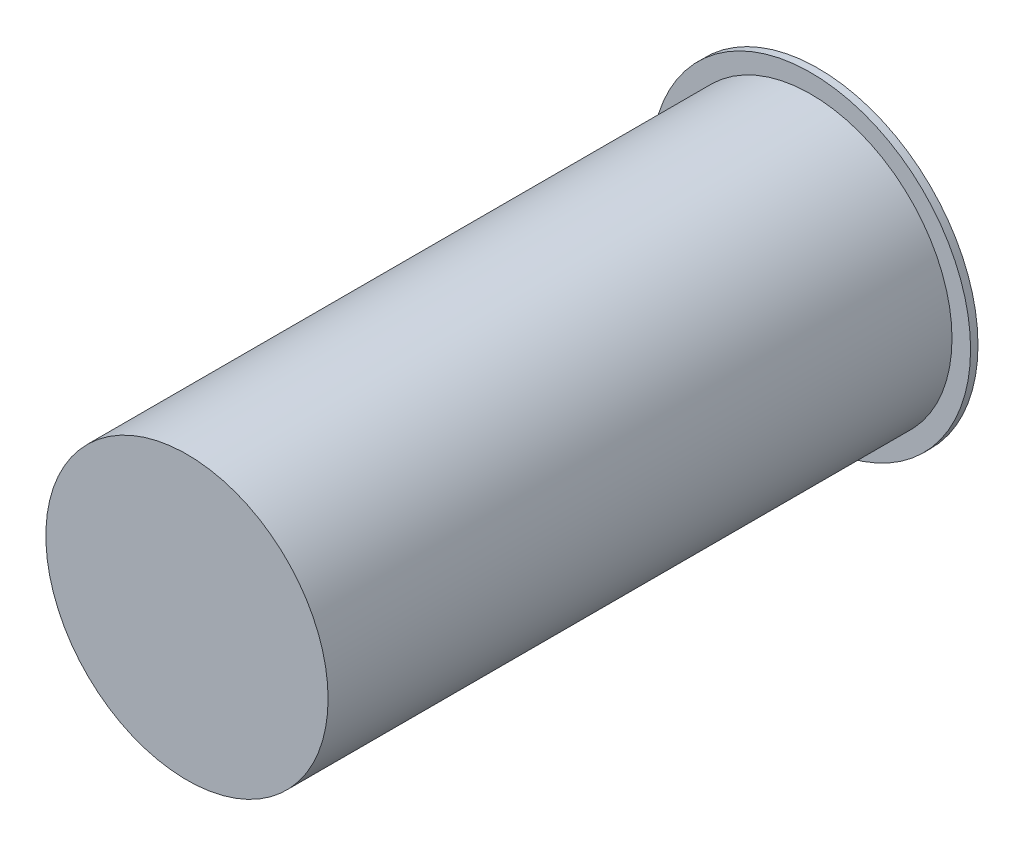
ISO-10303-21;
HEADER;
FILE_DESCRIPTION(('STEP AP214'),'2;1');
FILE_NAME('part.step','',(''),(''),'','','');
FILE_SCHEMA(('AUTOMOTIVE_DESIGN { 1 0 10303 214 1 1 1 1 }'));
ENDSEC;
DATA;
#1=APPLICATION_CONTEXT('core data for automotive mechanical design processes');
#2=APPLICATION_PROTOCOL_DEFINITION('international standard','automotive_design',2000,#1);
#3=PRODUCT_CONTEXT('',#1,'mechanical');
#4=PRODUCT('Part','Part','',(#3));
#5=PRODUCT_RELATED_PRODUCT_CATEGORY('part','',(#4));
#6=PRODUCT_DEFINITION_FORMATION('','',#4);
#7=PRODUCT_DEFINITION_CONTEXT('part definition',#1,'design');
#8=PRODUCT_DEFINITION('design','',#6,#7);
#9=PRODUCT_DEFINITION_SHAPE('','',#8);
#10=(LENGTH_UNIT() NAMED_UNIT(*) SI_UNIT(.MILLI.,.METRE.));
#11=(NAMED_UNIT(*) PLANE_ANGLE_UNIT() SI_UNIT($,.RADIAN.));
#12=(NAMED_UNIT(*) SI_UNIT($,.STERADIAN.) SOLID_ANGLE_UNIT());
#13=UNCERTAINTY_MEASURE_WITH_UNIT(LENGTH_MEASURE(1.E-05),#10,'distance_accuracy_value','');
#14=(GEOMETRIC_REPRESENTATION_CONTEXT(3) GLOBAL_UNCERTAINTY_ASSIGNED_CONTEXT((#13)) GLOBAL_UNIT_ASSIGNED_CONTEXT((#10,
#11,#12)) REPRESENTATION_CONTEXT('',''));
#15=CARTESIAN_POINT('',(0.,0.,0.));
#16=DIRECTION('',(0.,0.,1.));
#17=DIRECTION('',(1.,0.,0.));
#18=AXIS2_PLACEMENT_3D('',#15,#16,#17);
#19=CARTESIAN_POINT('',(8.,0.,-2.));
#20=DIRECTION('',(0.,0.,-1.));
#21=DIRECTION('',(-1.,0.,0.));
#22=AXIS2_PLACEMENT_3D('',#19,#20,#21);
#23=PLANE('',#22);
#24=CARTESIAN_POINT('',(0.,0.,-2.));
#25=DIRECTION('',(0.,0.,1.));
#26=DIRECTION('',(1.,0.,0.));
#27=AXIS2_PLACEMENT_3D('',#24,#25,#26);
#28=CIRCLE('',#27,8.);
#29=CARTESIAN_POINT('',(8.,0.,-2.));
#30=VERTEX_POINT('',#29);
#31=EDGE_CURVE('E54',#30,#30,#28,.T.);
#32=ORIENTED_EDGE('',*,*,#31,.F.);
#33=EDGE_LOOP('',(#32));
#34=FACE_BOUND('',#33,.T.);
#35=ADVANCED_FACE('F35',(#34),#23,.T.);
#36=CARTESIAN_POINT('',(0.,0.,42.));
#37=DIRECTION('',(0.,0.,1.));
#38=DIRECTION('',(1.,0.,0.));
#39=AXIS2_PLACEMENT_3D('',#36,#37,#38);
#40=PLANE('',#39);
#41=CARTESIAN_POINT('',(0.,0.,42.));
#42=DIRECTION('',(0.,0.,1.));
#43=DIRECTION('',(1.,0.,0.));
#44=AXIS2_PLACEMENT_3D('',#41,#42,#43);
#45=CIRCLE('',#44,9.5);
#46=CARTESIAN_POINT('',(9.5,0.,42.));
#47=VERTEX_POINT('',#46);
#48=EDGE_CURVE('E10',#47,#47,#45,.T.);
#49=ORIENTED_EDGE('',*,*,#48,.T.);
#50=EDGE_LOOP('',(#49));
#51=FACE_BOUND('',#50,.T.);
#52=ADVANCED_FACE('F62',(#51),#40,.T.);
#53=CARTESIAN_POINT('',(0.,0.,0.));
#54=DIRECTION('',(0.,0.,1.));
#55=DIRECTION('',(1.,0.,0.));
#56=AXIS2_PLACEMENT_3D('',#53,#54,#55);
#57=CYLINDRICAL_SURFACE('',#56,9.5);
#58=CARTESIAN_POINT('',(0.,0.,0.));
#59=DIRECTION('',(0.,0.,1.));
#60=DIRECTION('',(1.,0.,0.));
#61=AXIS2_PLACEMENT_3D('',#58,#59,#60);
#62=CIRCLE('',#61,9.5);
#63=CARTESIAN_POINT('',(9.5,0.,0.));
#64=VERTEX_POINT('',#63);
#65=EDGE_CURVE('E41',#64,#64,#62,.T.);
#66=ORIENTED_EDGE('',*,*,#65,.T.);
#67=EDGE_LOOP('',(#66));
#68=FACE_BOUND('',#67,.T.);
#69=ORIENTED_EDGE('',*,*,#48,.F.);
#70=EDGE_LOOP('',(#69));
#71=FACE_BOUND('',#70,.T.);
#72=ADVANCED_FACE('F66',(#68,#71),#57,.T.);
#73=CARTESIAN_POINT('',(9.5,0.,0.));
#74=DIRECTION('',(0.,0.,1.));
#75=DIRECTION('',(1.,0.,0.));
#76=AXIS2_PLACEMENT_3D('',#73,#74,#75);
#77=PLANE('',#76);
#78=CARTESIAN_POINT('',(0.,0.,0.));
#79=DIRECTION('',(0.,0.,1.));
#80=DIRECTION('',(1.,0.,0.));
#81=AXIS2_PLACEMENT_3D('',#78,#79,#80);
#82=CIRCLE('',#81,10.75);
#83=CARTESIAN_POINT('',(10.75,0.,0.));
#84=VERTEX_POINT('',#83);
#85=EDGE_CURVE('E45',#84,#84,#82,.T.);
#86=ORIENTED_EDGE('',*,*,#85,.T.);
#87=EDGE_LOOP('',(#86));
#88=FACE_BOUND('',#87,.T.);
#89=ORIENTED_EDGE('',*,*,#65,.F.);
#90=EDGE_LOOP('',(#89));
#91=FACE_BOUND('',#90,.T.);
#92=ADVANCED_FACE('F70',(#88,#91),#77,.T.);
#93=CARTESIAN_POINT('',(0.,0.,0.));
#94=DIRECTION('',(0.,0.,1.));
#95=DIRECTION('',(1.,0.,0.));
#96=AXIS2_PLACEMENT_3D('',#93,#94,#95);
#97=CYLINDRICAL_SURFACE('',#96,10.75);
#98=CARTESIAN_POINT('',(0.,0.,-0.5));
#99=DIRECTION('',(0.,0.,1.));
#100=DIRECTION('',(1.,0.,0.));
#101=AXIS2_PLACEMENT_3D('',#98,#99,#100);
#102=CIRCLE('',#101,10.75);
#103=CARTESIAN_POINT('',(10.75,0.,-0.5));
#104=VERTEX_POINT('',#103);
#105=EDGE_CURVE('E49',#104,#104,#102,.T.);
#106=ORIENTED_EDGE('',*,*,#105,.T.);
#107=EDGE_LOOP('',(#106));
#108=FACE_BOUND('',#107,.T.);
#109=ORIENTED_EDGE('',*,*,#85,.F.);
#110=EDGE_LOOP('',(#109));
#111=FACE_BOUND('',#110,.T.);
#112=ADVANCED_FACE('F75',(#108,#111),#97,.T.);
#113=CARTESIAN_POINT('',(0.,0.,-0.5));
#114=DIRECTION('',(0.,0.,1.));
#115=DIRECTION('',(1.,0.,0.));
#116=AXIS2_PLACEMENT_3D('',#113,#114,#115);
#117=CONICAL_SURFACE('',#116,10.75,1.07144960511477);
#118=ORIENTED_EDGE('',*,*,#31,.T.);
#119=EDGE_LOOP('',(#118));
#120=FACE_BOUND('',#119,.T.);
#121=ORIENTED_EDGE('',*,*,#105,.F.);
#122=EDGE_LOOP('',(#121));
#123=FACE_BOUND('',#122,.T.);
#124=ADVANCED_FACE('F58',(#120,#123),#117,.T.);
#125=CLOSED_SHELL('',(#35,#52,#72,#92,#112,#124));
#126=MANIFOLD_SOLID_BREP('B2',#125);
#127=ADVANCED_BREP_SHAPE_REPRESENTATION('',(#18,#126),#14);
#128=SHAPE_DEFINITION_REPRESENTATION(#9,#127);
ENDSEC;
END-ISO-10303-21;
